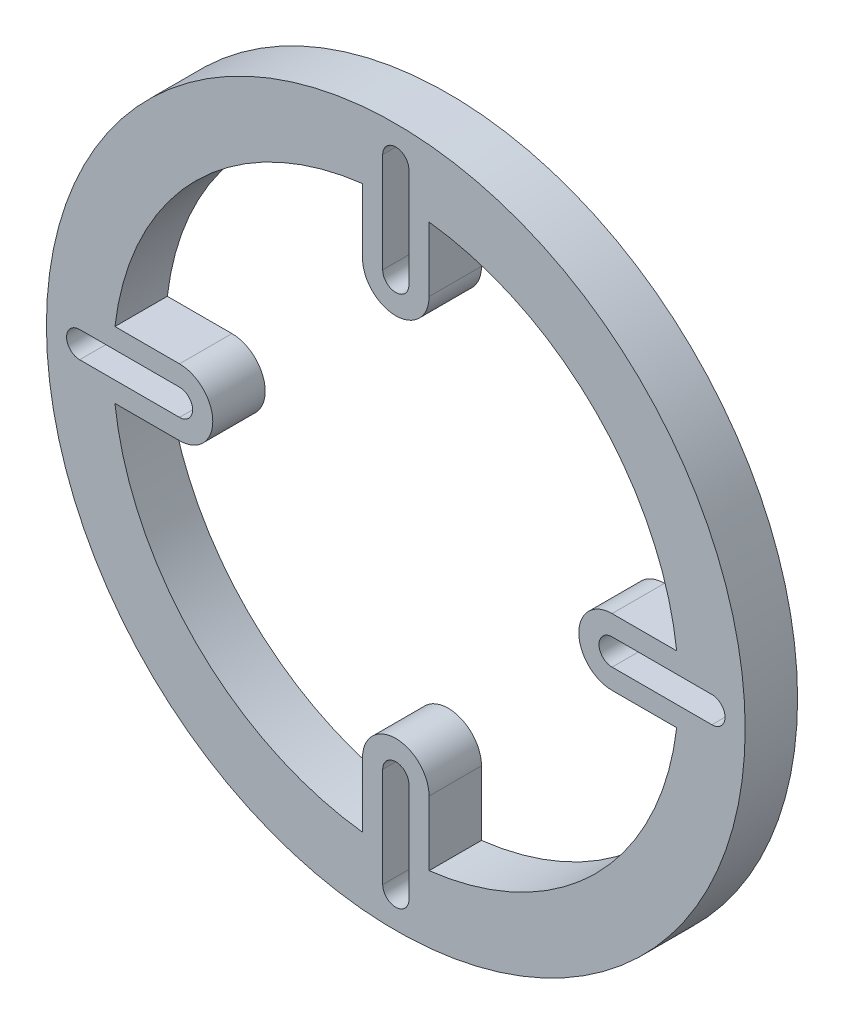
ISO-10303-21;
HEADER;
FILE_DESCRIPTION(('STEP AP214'),'2;1');
FILE_NAME('part.step','',(''),(''),'','','');
FILE_SCHEMA(('AUTOMOTIVE_DESIGN { 1 0 10303 214 1 1 1 1 }'));
ENDSEC;
DATA;
#1=APPLICATION_CONTEXT('core data for automotive mechanical design processes');
#2=APPLICATION_PROTOCOL_DEFINITION('international standard','automotive_design',2000,#1);
#3=PRODUCT_CONTEXT('',#1,'mechanical');
#4=PRODUCT('Part','Part','',(#3));
#5=PRODUCT_RELATED_PRODUCT_CATEGORY('part','',(#4));
#6=PRODUCT_DEFINITION_FORMATION('','',#4);
#7=PRODUCT_DEFINITION_CONTEXT('part definition',#1,'design');
#8=PRODUCT_DEFINITION('design','',#6,#7);
#9=PRODUCT_DEFINITION_SHAPE('','',#8);
#10=(LENGTH_UNIT() NAMED_UNIT(*) SI_UNIT(.MILLI.,.METRE.));
#11=(NAMED_UNIT(*) PLANE_ANGLE_UNIT() SI_UNIT($,.RADIAN.));
#12=(NAMED_UNIT(*) SI_UNIT($,.STERADIAN.) SOLID_ANGLE_UNIT());
#13=UNCERTAINTY_MEASURE_WITH_UNIT(LENGTH_MEASURE(1.E-05),#10,'distance_accuracy_value','');
#14=(GEOMETRIC_REPRESENTATION_CONTEXT(3) GLOBAL_UNCERTAINTY_ASSIGNED_CONTEXT((#13)) GLOBAL_UNIT_ASSIGNED_CONTEXT((#10,
#11,#12)) REPRESENTATION_CONTEXT('',''));
#15=CARTESIAN_POINT('',(0.,0.,0.));
#16=DIRECTION('',(0.,0.,1.));
#17=DIRECTION('',(1.,0.,0.));
#18=AXIS2_PLACEMENT_3D('',#15,#16,#17);
#19=CARTESIAN_POINT('',(0.,0.,8.));
#20=DIRECTION('',(0.,0.,1.));
#21=DIRECTION('',(1.,0.,0.));
#22=AXIS2_PLACEMENT_3D('',#19,#20,#21);
#23=PLANE('',#22);
#24=DIRECTION('',(1.,0.,0.));
#25=VECTOR('',#24,1.);
#26=CARTESIAN_POINT('',(0.,-2.,8.));
#27=LINE('',#26,#25);
#28=CARTESIAN_POINT('',(33.02,-2.,8.));
#29=VERTEX_POINT('',#28);
#30=CARTESIAN_POINT('',(48.26,-2.00000000000001,8.));
#31=VERTEX_POINT('',#30);
#32=EDGE_CURVE('E107',#29,#31,#27,.T.);
#33=ORIENTED_EDGE('',*,*,#32,.F.);
#34=CARTESIAN_POINT('',(33.02,0.,8.));
#35=DIRECTION('',(0.,0.,-1.));
#36=DIRECTION('',(-1.,0.,0.));
#37=AXIS2_PLACEMENT_3D('',#34,#35,#36);
#38=CIRCLE('',#37,2.);
#39=CARTESIAN_POINT('',(33.02,2.,8.));
#40=VERTEX_POINT('',#39);
#41=EDGE_CURVE('E318',#29,#40,#38,.T.);
#42=ORIENTED_EDGE('',*,*,#41,.T.);
#43=DIRECTION('',(1.,0.,0.));
#44=VECTOR('',#43,1.);
#45=CARTESIAN_POINT('',(0.,2.,8.));
#46=LINE('',#45,#44);
#47=CARTESIAN_POINT('',(48.26,2.00000000000001,8.));
#48=VERTEX_POINT('',#47);
#49=EDGE_CURVE('E322',#40,#48,#46,.T.);
#50=ORIENTED_EDGE('',*,*,#49,.T.);
#51=CARTESIAN_POINT('',(48.26,0.,8.));
#52=DIRECTION('',(0.,0.,-1.));
#53=DIRECTION('',(-1.,0.,0.));
#54=AXIS2_PLACEMENT_3D('',#51,#52,#53);
#55=CIRCLE('',#54,2.);
#56=EDGE_CURVE('E313',#48,#31,#55,.T.);
#57=ORIENTED_EDGE('',*,*,#56,.T.);
#58=EDGE_LOOP('',(#33,#42,#50,#57));
#59=FACE_BOUND('',#58,.T.);
#60=CARTESIAN_POINT('',(-33.02,0.,8.));
#61=DIRECTION('',(0.,0.,1.));
#62=DIRECTION('',(1.,0.,0.));
#63=AXIS2_PLACEMENT_3D('',#60,#61,#62);
#64=CIRCLE('',#63,2.);
#65=CARTESIAN_POINT('',(-33.02,-2.,8.));
#66=VERTEX_POINT('',#65);
#67=CARTESIAN_POINT('',(-33.02,2.,8.));
#68=VERTEX_POINT('',#67);
#69=EDGE_CURVE('E341',#66,#68,#64,.T.);
#70=ORIENTED_EDGE('',*,*,#69,.F.);
#71=DIRECTION('',(-1.,0.,0.));
#72=VECTOR('',#71,1.);
#73=CARTESIAN_POINT('',(0.,-2.,8.));
#74=LINE('',#73,#72);
#75=CARTESIAN_POINT('',(-48.26,-2.00000000000001,8.));
#76=VERTEX_POINT('',#75);
#77=EDGE_CURVE('E338',#66,#76,#74,.T.);
#78=ORIENTED_EDGE('',*,*,#77,.T.);
#79=CARTESIAN_POINT('',(-48.26,0.,8.));
#80=DIRECTION('',(0.,0.,1.));
#81=DIRECTION('',(1.,0.,0.));
#82=AXIS2_PLACEMENT_3D('',#79,#80,#81);
#83=CIRCLE('',#82,2.);
#84=CARTESIAN_POINT('',(-48.26,2.,8.));
#85=VERTEX_POINT('',#84);
#86=EDGE_CURVE('E329',#85,#76,#83,.T.);
#87=ORIENTED_EDGE('',*,*,#86,.F.);
#88=DIRECTION('',(-1.,0.,0.));
#89=VECTOR('',#88,1.);
#90=CARTESIAN_POINT('',(0.,2.,8.));
#91=LINE('',#90,#89);
#92=EDGE_CURVE('E344',#68,#85,#91,.T.);
#93=ORIENTED_EDGE('',*,*,#92,.F.);
#94=EDGE_LOOP('',(#70,#78,#87,#93));
#95=FACE_BOUND('',#94,.T.);
#96=CARTESIAN_POINT('',(0.,0.,8.));
#97=DIRECTION('',(0.,0.,1.));
#98=DIRECTION('',(1.,0.,0.));
#99=AXIS2_PLACEMENT_3D('',#96,#97,#98);
#100=CIRCLE('',#99,43.18);
#101=CARTESIAN_POINT('',(-5.08,42.8801352609807,8.));
#102=VERTEX_POINT('',#101);
#103=CARTESIAN_POINT('',(-42.8801352609807,5.08,8.));
#104=VERTEX_POINT('',#103);
#105=EDGE_CURVE('E542',#102,#104,#100,.T.);
#106=ORIENTED_EDGE('',*,*,#105,.F.);
#107=DIRECTION('',(0.,-1.,0.));
#108=VECTOR('',#107,1.);
#109=CARTESIAN_POINT('',(-5.07999999999995,-117.489421356237,8.));
#110=LINE('',#109,#108);
#111=CARTESIAN_POINT('',(-5.08,33.02,8.));
#112=VERTEX_POINT('',#111);
#113=EDGE_CURVE('E514',#102,#112,#110,.T.);
#114=ORIENTED_EDGE('',*,*,#113,.T.);
#115=CARTESIAN_POINT('',(0.,33.02,8.));
#116=DIRECTION('',(0.,0.,1.));
#117=DIRECTION('',(1.,0.,0.));
#118=AXIS2_PLACEMENT_3D('',#115,#116,#117);
#119=CIRCLE('',#118,5.08);
#120=CARTESIAN_POINT('',(5.08,33.02,8.));
#121=VERTEX_POINT('',#120);
#122=EDGE_CURVE('E500',#112,#121,#119,.T.);
#123=ORIENTED_EDGE('',*,*,#122,.T.);
#124=DIRECTION('',(0.,-1.,0.));
#125=VECTOR('',#124,1.);
#126=CARTESIAN_POINT('',(5.07999999999995,-117.489421356237,8.));
#127=LINE('',#126,#125);
#128=CARTESIAN_POINT('',(5.08,42.8801352609807,8.));
#129=VERTEX_POINT('',#128);
#130=EDGE_CURVE('E511',#129,#121,#127,.T.);
#131=ORIENTED_EDGE('',*,*,#130,.F.);
#132=CARTESIAN_POINT('',(42.8801352609807,5.08,8.));
#133=VERTEX_POINT('',#132);
#134=EDGE_CURVE('E539',#133,#129,#100,.T.);
#135=ORIENTED_EDGE('',*,*,#134,.F.);
#136=DIRECTION('',(-1.,0.,0.));
#137=VECTOR('',#136,1.);
#138=CARTESIAN_POINT('',(0.,5.08,8.));
#139=LINE('',#138,#137);
#140=CARTESIAN_POINT('',(33.02,5.08,8.));
#141=VERTEX_POINT('',#140);
#142=EDGE_CURVE('E434',#133,#141,#139,.T.);
#143=ORIENTED_EDGE('',*,*,#142,.T.);
#144=CARTESIAN_POINT('',(33.02,0.,8.));
#145=DIRECTION('',(0.,0.,-1.));
#146=DIRECTION('',(-1.,0.,0.));
#147=AXIS2_PLACEMENT_3D('',#144,#145,#146);
#148=CIRCLE('',#147,5.08);
#149=CARTESIAN_POINT('',(33.02,-5.08,8.));
#150=VERTEX_POINT('',#149);
#151=EDGE_CURVE('E420',#150,#141,#148,.T.);
#152=ORIENTED_EDGE('',*,*,#151,.F.);
#153=DIRECTION('',(-1.,0.,0.));
#154=VECTOR('',#153,1.);
#155=CARTESIAN_POINT('',(0.,-5.08,8.));
#156=LINE('',#155,#154);
#157=CARTESIAN_POINT('',(42.8801352609807,-5.08,8.));
#158=VERTEX_POINT('',#157);
#159=EDGE_CURVE('E431',#158,#150,#156,.T.);
#160=ORIENTED_EDGE('',*,*,#159,.F.);
#161=CARTESIAN_POINT('',(5.08,-42.8801352609807,8.));
#162=VERTEX_POINT('',#161);
#163=EDGE_CURVE('E545',#162,#158,#100,.T.);
#164=ORIENTED_EDGE('',*,*,#163,.F.);
#165=DIRECTION('',(0.,1.,0.));
#166=VECTOR('',#165,1.);
#167=CARTESIAN_POINT('',(5.07999999999995,117.489421356237,8.));
#168=LINE('',#167,#166);
#169=CARTESIAN_POINT('',(5.08,-33.02,8.));
#170=VERTEX_POINT('',#169);
#171=EDGE_CURVE('E487',#162,#170,#168,.T.);
#172=ORIENTED_EDGE('',*,*,#171,.T.);
#173=CARTESIAN_POINT('',(0.,-33.02,8.));
#174=DIRECTION('',(0.,0.,-1.));
#175=DIRECTION('',(1.,0.,0.));
#176=AXIS2_PLACEMENT_3D('',#173,#174,#175);
#177=CIRCLE('',#176,5.08);
#178=CARTESIAN_POINT('',(-5.08,-33.02,8.));
#179=VERTEX_POINT('',#178);
#180=EDGE_CURVE('E476',#179,#170,#177,.T.);
#181=ORIENTED_EDGE('',*,*,#180,.F.);
#182=DIRECTION('',(0.,1.,0.));
#183=VECTOR('',#182,1.);
#184=CARTESIAN_POINT('',(-5.07999999999995,117.489421356237,8.));
#185=LINE('',#184,#183);
#186=CARTESIAN_POINT('',(-5.08,-42.8801352609807,8.));
#187=VERTEX_POINT('',#186);
#188=EDGE_CURVE('E485',#187,#179,#185,.T.);
#189=ORIENTED_EDGE('',*,*,#188,.F.);
#190=CARTESIAN_POINT('',(-42.8801352609807,-5.08,8.));
#191=VERTEX_POINT('',#190);
#192=EDGE_CURVE('E544',#191,#187,#100,.T.);
#193=ORIENTED_EDGE('',*,*,#192,.F.);
#194=DIRECTION('',(1.,0.,0.));
#195=VECTOR('',#194,1.);
#196=CARTESIAN_POINT('',(0.,-5.08,8.));
#197=LINE('',#196,#195);
#198=CARTESIAN_POINT('',(-33.02,-5.08,8.));
#199=VERTEX_POINT('',#198);
#200=EDGE_CURVE('E464',#191,#199,#197,.T.);
#201=ORIENTED_EDGE('',*,*,#200,.T.);
#202=CARTESIAN_POINT('',(-33.02,0.,8.));
#203=DIRECTION('',(0.,0.,1.));
#204=DIRECTION('',(1.,0.,0.));
#205=AXIS2_PLACEMENT_3D('',#202,#203,#204);
#206=CIRCLE('',#205,5.08);
#207=CARTESIAN_POINT('',(-33.02,5.08,8.));
#208=VERTEX_POINT('',#207);
#209=EDGE_CURVE('E447',#199,#208,#206,.T.);
#210=ORIENTED_EDGE('',*,*,#209,.T.);
#211=DIRECTION('',(1.,0.,0.));
#212=VECTOR('',#211,1.);
#213=CARTESIAN_POINT('',(0.,5.08,8.));
#214=LINE('',#213,#212);
#215=EDGE_CURVE('E461',#104,#208,#214,.T.);
#216=ORIENTED_EDGE('',*,*,#215,.F.);
#217=EDGE_LOOP('',(#106,#114,#123,#131,#135,#143,#152,#160,#164,#172,#181,#189,#193,#201,#210,#216));
#218=FACE_BOUND('',#217,.T.);
#219=CARTESIAN_POINT('',(0.,0.,8.));
#220=DIRECTION('',(0.,0.,1.));
#221=DIRECTION('',(1.,0.,0.));
#222=AXIS2_PLACEMENT_3D('',#219,#220,#221);
#223=CIRCLE('',#222,53.34);
#224=CARTESIAN_POINT('',(53.34,0.,8.));
#225=VERTEX_POINT('',#224);
#226=EDGE_CURVE('E12',#225,#225,#223,.T.);
#227=ORIENTED_EDGE('',*,*,#226,.T.);
#228=EDGE_LOOP('',(#227));
#229=FACE_BOUND('',#228,.T.);
#230=DIRECTION('',(0.,-1.,0.));
#231=VECTOR('',#230,1.);
#232=CARTESIAN_POINT('',(-1.99999999999998,-117.489421356237,8.));
#233=LINE('',#232,#231);
#234=CARTESIAN_POINT('',(-2.,48.26,8.));
#235=VERTEX_POINT('',#234);
#236=CARTESIAN_POINT('',(-2.,33.02,8.));
#237=VERTEX_POINT('',#236);
#238=EDGE_CURVE('E388',#235,#237,#233,.T.);
#239=ORIENTED_EDGE('',*,*,#238,.F.);
#240=CARTESIAN_POINT('',(0.,48.26,8.));
#241=DIRECTION('',(0.,0.,1.));
#242=DIRECTION('',(1.,0.,0.));
#243=AXIS2_PLACEMENT_3D('',#240,#241,#242);
#244=CIRCLE('',#243,2.);
#245=CARTESIAN_POINT('',(2.,48.26,8.));
#246=VERTEX_POINT('',#245);
#247=EDGE_CURVE('E402',#246,#235,#244,.T.);
#248=ORIENTED_EDGE('',*,*,#247,.F.);
#249=DIRECTION('',(0.,-1.,0.));
#250=VECTOR('',#249,1.);
#251=CARTESIAN_POINT('',(1.99999999999998,-117.489421356237,8.));
#252=LINE('',#251,#250);
#253=CARTESIAN_POINT('',(2.,33.02,8.));
#254=VERTEX_POINT('',#253);
#255=EDGE_CURVE('E399',#246,#254,#252,.T.);
#256=ORIENTED_EDGE('',*,*,#255,.T.);
#257=CARTESIAN_POINT('',(0.,33.02,8.));
#258=DIRECTION('',(0.,0.,1.));
#259=DIRECTION('',(1.,0.,0.));
#260=AXIS2_PLACEMENT_3D('',#257,#258,#259);
#261=CIRCLE('',#260,2.);
#262=EDGE_CURVE('E396',#237,#254,#261,.T.);
#263=ORIENTED_EDGE('',*,*,#262,.F.);
#264=EDGE_LOOP('',(#239,#248,#256,#263));
#265=FACE_BOUND('',#264,.T.);
#266=CARTESIAN_POINT('',(0.,-48.26,8.));
#267=DIRECTION('',(0.,0.,-1.));
#268=DIRECTION('',(1.,0.,0.));
#269=AXIS2_PLACEMENT_3D('',#266,#267,#268);
#270=CIRCLE('',#269,2.);
#271=CARTESIAN_POINT('',(2.,-48.26,8.));
#272=VERTEX_POINT('',#271);
#273=CARTESIAN_POINT('',(-2.,-48.26,8.));
#274=VERTEX_POINT('',#273);
#275=EDGE_CURVE('E366',#272,#274,#270,.T.);
#276=ORIENTED_EDGE('',*,*,#275,.T.);
#277=DIRECTION('',(0.,1.,0.));
#278=VECTOR('',#277,1.);
#279=CARTESIAN_POINT('',(-1.99999999999998,117.489421356237,8.));
#280=LINE('',#279,#278);
#281=CARTESIAN_POINT('',(-2.,-33.02,8.));
#282=VERTEX_POINT('',#281);
#283=EDGE_CURVE('E357',#274,#282,#280,.T.);
#284=ORIENTED_EDGE('',*,*,#283,.T.);
#285=CARTESIAN_POINT('',(0.,-33.02,8.));
#286=DIRECTION('',(0.,0.,-1.));
#287=DIRECTION('',(1.,0.,0.));
#288=AXIS2_PLACEMENT_3D('',#285,#286,#287);
#289=CIRCLE('',#288,2.);
#290=CARTESIAN_POINT('',(2.,-33.02,8.));
#291=VERTEX_POINT('',#290);
#292=EDGE_CURVE('E372',#282,#291,#289,.T.);
#293=ORIENTED_EDGE('',*,*,#292,.T.);
#294=DIRECTION('',(0.,1.,0.));
#295=VECTOR('',#294,1.);
#296=CARTESIAN_POINT('',(1.99999999999998,117.489421356237,8.));
#297=LINE('',#296,#295);
#298=EDGE_CURVE('E369',#272,#291,#297,.T.);
#299=ORIENTED_EDGE('',*,*,#298,.F.);
#300=EDGE_LOOP('',(#276,#284,#293,#299));
#301=FACE_BOUND('',#300,.T.);
#302=ADVANCED_FACE('F92',(#59,#95,#218,#229,#265,#301),#23,.T.);
#303=CARTESIAN_POINT('',(0.,0.,0.));
#304=DIRECTION('',(0.,0.,1.));
#305=DIRECTION('',(1.,0.,0.));
#306=AXIS2_PLACEMENT_3D('',#303,#304,#305);
#307=PLANE('',#306);
#308=CARTESIAN_POINT('',(33.02,0.,0.));
#309=DIRECTION('',(0.,0.,-1.));
#310=DIRECTION('',(-1.,0.,0.));
#311=AXIS2_PLACEMENT_3D('',#308,#309,#310);
#312=CIRCLE('',#311,2.);
#313=CARTESIAN_POINT('',(33.02,-2.,0.));
#314=VERTEX_POINT('',#313);
#315=CARTESIAN_POINT('',(33.02,2.,0.));
#316=VERTEX_POINT('',#315);
#317=EDGE_CURVE('E306',#314,#316,#312,.T.);
#318=ORIENTED_EDGE('',*,*,#317,.F.);
#319=DIRECTION('',(1.,0.,0.));
#320=VECTOR('',#319,1.);
#321=CARTESIAN_POINT('',(0.,-2.,0.));
#322=LINE('',#321,#320);
#323=CARTESIAN_POINT('',(48.26,-2.00000000000001,0.));
#324=VERTEX_POINT('',#323);
#325=EDGE_CURVE('E303',#314,#324,#322,.T.);
#326=ORIENTED_EDGE('',*,*,#325,.T.);
#327=CARTESIAN_POINT('',(48.26,0.,0.));
#328=DIRECTION('',(0.,0.,-1.));
#329=DIRECTION('',(-1.,0.,0.));
#330=AXIS2_PLACEMENT_3D('',#327,#328,#329);
#331=CIRCLE('',#330,2.);
#332=CARTESIAN_POINT('',(48.26,2.,0.));
#333=VERTEX_POINT('',#332);
#334=EDGE_CURVE('E309',#333,#324,#331,.T.);
#335=ORIENTED_EDGE('',*,*,#334,.F.);
#336=DIRECTION('',(1.,0.,0.));
#337=VECTOR('',#336,1.);
#338=CARTESIAN_POINT('',(0.,2.,0.));
#339=LINE('',#338,#337);
#340=EDGE_CURVE('E317',#316,#333,#339,.T.);
#341=ORIENTED_EDGE('',*,*,#340,.F.);
#342=EDGE_LOOP('',(#318,#326,#335,#341));
#343=FACE_BOUND('',#342,.T.);
#344=DIRECTION('',(-1.,0.,0.));
#345=VECTOR('',#344,1.);
#346=CARTESIAN_POINT('',(0.,-2.,0.));
#347=LINE('',#346,#345);
#348=CARTESIAN_POINT('',(-33.02,-2.,0.));
#349=VERTEX_POINT('',#348);
#350=CARTESIAN_POINT('',(-48.26,-2.00000000000001,0.));
#351=VERTEX_POINT('',#350);
#352=EDGE_CURVE('E346',#349,#351,#347,.T.);
#353=ORIENTED_EDGE('',*,*,#352,.F.);
#354=CARTESIAN_POINT('',(-33.02,0.,0.));
#355=DIRECTION('',(0.,0.,1.));
#356=DIRECTION('',(1.,0.,0.));
#357=AXIS2_PLACEMENT_3D('',#354,#355,#356);
#358=CIRCLE('',#357,2.);
#359=CARTESIAN_POINT('',(-33.02,2.,0.));
#360=VERTEX_POINT('',#359);
#361=EDGE_CURVE('E348',#349,#360,#358,.T.);
#362=ORIENTED_EDGE('',*,*,#361,.T.);
#363=DIRECTION('',(-1.,0.,0.));
#364=VECTOR('',#363,1.);
#365=CARTESIAN_POINT('',(0.,2.,0.));
#366=LINE('',#365,#364);
#367=CARTESIAN_POINT('',(-48.26,2.00000000000001,0.));
#368=VERTEX_POINT('',#367);
#369=EDGE_CURVE('E351',#360,#368,#366,.T.);
#370=ORIENTED_EDGE('',*,*,#369,.T.);
#371=CARTESIAN_POINT('',(-48.26,0.,0.));
#372=DIRECTION('',(0.,0.,1.));
#373=DIRECTION('',(1.,0.,0.));
#374=AXIS2_PLACEMENT_3D('',#371,#372,#373);
#375=CIRCLE('',#374,2.);
#376=EDGE_CURVE('E335',#368,#351,#375,.T.);
#377=ORIENTED_EDGE('',*,*,#376,.T.);
#378=EDGE_LOOP('',(#353,#362,#370,#377));
#379=FACE_BOUND('',#378,.T.);
#380=CARTESIAN_POINT('',(0.,0.,0.));
#381=DIRECTION('',(0.,0.,1.));
#382=DIRECTION('',(1.,0.,0.));
#383=AXIS2_PLACEMENT_3D('',#380,#381,#382);
#384=CIRCLE('',#383,43.18);
#385=CARTESIAN_POINT('',(-5.08,42.8801352609807,0.));
#386=VERTEX_POINT('',#385);
#387=CARTESIAN_POINT('',(-42.8801352609807,5.08,0.));
#388=VERTEX_POINT('',#387);
#389=EDGE_CURVE('E536',#386,#388,#384,.T.);
#390=ORIENTED_EDGE('',*,*,#389,.T.);
#391=DIRECTION('',(1.,0.,0.));
#392=VECTOR('',#391,1.);
#393=CARTESIAN_POINT('',(0.,5.08,0.));
#394=LINE('',#393,#392);
#395=CARTESIAN_POINT('',(-33.02,5.08,0.));
#396=VERTEX_POINT('',#395);
#397=EDGE_CURVE('E467',#388,#396,#394,.T.);
#398=ORIENTED_EDGE('',*,*,#397,.T.);
#399=CARTESIAN_POINT('',(-33.02,0.,0.));
#400=DIRECTION('',(0.,0.,1.));
#401=DIRECTION('',(1.,0.,0.));
#402=AXIS2_PLACEMENT_3D('',#399,#400,#401);
#403=CIRCLE('',#402,5.08);
#404=CARTESIAN_POINT('',(-33.02,-5.08,0.));
#405=VERTEX_POINT('',#404);
#406=EDGE_CURVE('E458',#405,#396,#403,.T.);
#407=ORIENTED_EDGE('',*,*,#406,.F.);
#408=DIRECTION('',(1.,0.,0.));
#409=VECTOR('',#408,1.);
#410=CARTESIAN_POINT('',(0.,-5.08,0.));
#411=LINE('',#410,#409);
#412=CARTESIAN_POINT('',(-42.8801352609807,-5.08,0.));
#413=VERTEX_POINT('',#412);
#414=EDGE_CURVE('E470',#413,#405,#411,.T.);
#415=ORIENTED_EDGE('',*,*,#414,.F.);
#416=CARTESIAN_POINT('',(-5.08,-42.8801352609807,0.));
#417=VERTEX_POINT('',#416);
#418=EDGE_CURVE('E540',#413,#417,#384,.T.);
#419=ORIENTED_EDGE('',*,*,#418,.T.);
#420=DIRECTION('',(0.,1.,0.));
#421=VECTOR('',#420,1.);
#422=CARTESIAN_POINT('',(-5.07999999999995,117.489421356237,0.));
#423=LINE('',#422,#421);
#424=CARTESIAN_POINT('',(-5.08,-33.02,0.));
#425=VERTEX_POINT('',#424);
#426=EDGE_CURVE('E492',#417,#425,#423,.T.);
#427=ORIENTED_EDGE('',*,*,#426,.T.);
#428=CARTESIAN_POINT('',(0.,-33.02,0.));
#429=DIRECTION('',(0.,0.,-1.));
#430=DIRECTION('',(1.,0.,0.));
#431=AXIS2_PLACEMENT_3D('',#428,#429,#430);
#432=CIRCLE('',#431,5.08);
#433=CARTESIAN_POINT('',(5.08,-33.02,0.));
#434=VERTEX_POINT('',#433);
#435=EDGE_CURVE('E490',#425,#434,#432,.T.);
#436=ORIENTED_EDGE('',*,*,#435,.T.);
#437=DIRECTION('',(0.,1.,0.));
#438=VECTOR('',#437,1.);
#439=CARTESIAN_POINT('',(5.07999999999995,117.489421356237,0.));
#440=LINE('',#439,#438);
#441=CARTESIAN_POINT('',(5.08,-42.8801352609807,0.));
#442=VERTEX_POINT('',#441);
#443=EDGE_CURVE('E494',#442,#434,#440,.T.);
#444=ORIENTED_EDGE('',*,*,#443,.F.);
#445=CARTESIAN_POINT('',(42.8801352609807,-5.08,0.));
#446=VERTEX_POINT('',#445);
#447=EDGE_CURVE('E541',#442,#446,#384,.T.);
#448=ORIENTED_EDGE('',*,*,#447,.T.);
#449=DIRECTION('',(-1.,0.,0.));
#450=VECTOR('',#449,1.);
#451=CARTESIAN_POINT('',(0.,-5.08,0.));
#452=LINE('',#451,#450);
#453=CARTESIAN_POINT('',(33.02,-5.08,0.));
#454=VERTEX_POINT('',#453);
#455=EDGE_CURVE('E437',#446,#454,#452,.T.);
#456=ORIENTED_EDGE('',*,*,#455,.T.);
#457=CARTESIAN_POINT('',(33.02,0.,0.));
#458=DIRECTION('',(0.,0.,-1.));
#459=DIRECTION('',(-1.,0.,0.));
#460=AXIS2_PLACEMENT_3D('',#457,#458,#459);
#461=CIRCLE('',#460,5.08);
#462=CARTESIAN_POINT('',(33.02,5.08,0.));
#463=VERTEX_POINT('',#462);
#464=EDGE_CURVE('E428',#454,#463,#461,.T.);
#465=ORIENTED_EDGE('',*,*,#464,.T.);
#466=DIRECTION('',(-1.,0.,0.));
#467=VECTOR('',#466,1.);
#468=CARTESIAN_POINT('',(0.,5.08,0.));
#469=LINE('',#468,#467);
#470=CARTESIAN_POINT('',(42.8801352609807,5.08,0.));
#471=VERTEX_POINT('',#470);
#472=EDGE_CURVE('E440',#471,#463,#469,.T.);
#473=ORIENTED_EDGE('',*,*,#472,.F.);
#474=CARTESIAN_POINT('',(5.08,42.8801352609807,0.));
#475=VERTEX_POINT('',#474);
#476=EDGE_CURVE('E528',#471,#475,#384,.T.);
#477=ORIENTED_EDGE('',*,*,#476,.T.);
#478=DIRECTION('',(0.,-1.,0.));
#479=VECTOR('',#478,1.);
#480=CARTESIAN_POINT('',(5.07999999999995,-117.489421356237,0.));
#481=LINE('',#480,#479);
#482=CARTESIAN_POINT('',(5.08,33.02,0.));
#483=VERTEX_POINT('',#482);
#484=EDGE_CURVE('E520',#475,#483,#481,.T.);
#485=ORIENTED_EDGE('',*,*,#484,.T.);
#486=CARTESIAN_POINT('',(0.,33.02,0.));
#487=DIRECTION('',(0.,0.,1.));
#488=DIRECTION('',(1.,0.,0.));
#489=AXIS2_PLACEMENT_3D('',#486,#487,#488);
#490=CIRCLE('',#489,5.08);
#491=CARTESIAN_POINT('',(-5.08,33.02,0.));
#492=VERTEX_POINT('',#491);
#493=EDGE_CURVE('E517',#492,#483,#490,.T.);
#494=ORIENTED_EDGE('',*,*,#493,.F.);
#495=DIRECTION('',(0.,-1.,0.));
#496=VECTOR('',#495,1.);
#497=CARTESIAN_POINT('',(-5.07999999999995,-117.489421356237,0.));
#498=LINE('',#497,#496);
#499=EDGE_CURVE('E522',#386,#492,#498,.T.);
#500=ORIENTED_EDGE('',*,*,#499,.F.);
#501=EDGE_LOOP('',(#390,#398,#407,#415,#419,#427,#436,#444,#448,#456,#465,#473,#477,#485,#494,#500));
#502=FACE_BOUND('',#501,.T.);
#503=CARTESIAN_POINT('',(0.,0.,0.));
#504=DIRECTION('',(0.,0.,1.));
#505=DIRECTION('',(1.,0.,0.));
#506=AXIS2_PLACEMENT_3D('',#503,#504,#505);
#507=CIRCLE('',#506,53.34);
#508=CARTESIAN_POINT('',(53.34,0.,0.));
#509=VERTEX_POINT('',#508);
#510=EDGE_CURVE('E100',#509,#509,#507,.T.);
#511=ORIENTED_EDGE('',*,*,#510,.F.);
#512=EDGE_LOOP('',(#511));
#513=FACE_BOUND('',#512,.T.);
#514=CARTESIAN_POINT('',(0.,48.26,0.));
#515=DIRECTION('',(0.,0.,1.));
#516=DIRECTION('',(1.,0.,0.));
#517=AXIS2_PLACEMENT_3D('',#514,#515,#516);
#518=CIRCLE('',#517,2.);
#519=CARTESIAN_POINT('',(2.,48.26,0.));
#520=VERTEX_POINT('',#519);
#521=CARTESIAN_POINT('',(-2.,48.26,0.));
#522=VERTEX_POINT('',#521);
#523=EDGE_CURVE('E414',#520,#522,#518,.T.);
#524=ORIENTED_EDGE('',*,*,#523,.T.);
#525=DIRECTION('',(0.,-1.,0.));
#526=VECTOR('',#525,1.);
#527=CARTESIAN_POINT('',(-1.99999999999998,-117.489421356237,0.));
#528=LINE('',#527,#526);
#529=CARTESIAN_POINT('',(-2.,33.02,0.));
#530=VERTEX_POINT('',#529);
#531=EDGE_CURVE('E405',#522,#530,#528,.T.);
#532=ORIENTED_EDGE('',*,*,#531,.T.);
#533=CARTESIAN_POINT('',(0.,33.02,0.));
#534=DIRECTION('',(0.,0.,1.));
#535=DIRECTION('',(1.,0.,0.));
#536=AXIS2_PLACEMENT_3D('',#533,#534,#535);
#537=CIRCLE('',#536,2.);
#538=CARTESIAN_POINT('',(2.,33.02,0.));
#539=VERTEX_POINT('',#538);
#540=EDGE_CURVE('E408',#530,#539,#537,.T.);
#541=ORIENTED_EDGE('',*,*,#540,.T.);
#542=DIRECTION('',(0.,-1.,0.));
#543=VECTOR('',#542,1.);
#544=CARTESIAN_POINT('',(1.99999999999998,-117.489421356237,0.));
#545=LINE('',#544,#543);
#546=EDGE_CURVE('E411',#520,#539,#545,.T.);
#547=ORIENTED_EDGE('',*,*,#546,.F.);
#548=EDGE_LOOP('',(#524,#532,#541,#547));
#549=FACE_BOUND('',#548,.T.);
#550=DIRECTION('',(0.,1.,0.));
#551=VECTOR('',#550,1.);
#552=CARTESIAN_POINT('',(-1.99999999999998,117.489421356237,0.));
#553=LINE('',#552,#551);
#554=CARTESIAN_POINT('',(-2.,-48.26,0.));
#555=VERTEX_POINT('',#554);
#556=CARTESIAN_POINT('',(-2.,-33.02,0.));
#557=VERTEX_POINT('',#556);
#558=EDGE_CURVE('E375',#555,#557,#553,.T.);
#559=ORIENTED_EDGE('',*,*,#558,.F.);
#560=CARTESIAN_POINT('',(0.,-48.26,0.));
#561=DIRECTION('',(0.,0.,-1.));
#562=DIRECTION('',(1.,0.,0.));
#563=AXIS2_PLACEMENT_3D('',#560,#561,#562);
#564=CIRCLE('',#563,2.);
#565=CARTESIAN_POINT('',(2.,-48.26,0.));
#566=VERTEX_POINT('',#565);
#567=EDGE_CURVE('E377',#566,#555,#564,.T.);
#568=ORIENTED_EDGE('',*,*,#567,.F.);
#569=DIRECTION('',(0.,1.,0.));
#570=VECTOR('',#569,1.);
#571=CARTESIAN_POINT('',(1.99999999999998,117.489421356237,0.));
#572=LINE('',#571,#570);
#573=CARTESIAN_POINT('',(2.,-33.02,0.));
#574=VERTEX_POINT('',#573);
#575=EDGE_CURVE('E379',#566,#574,#572,.T.);
#576=ORIENTED_EDGE('',*,*,#575,.T.);
#577=CARTESIAN_POINT('',(0.,-33.02,0.));
#578=DIRECTION('',(0.,0.,-1.));
#579=DIRECTION('',(1.,0.,0.));
#580=AXIS2_PLACEMENT_3D('',#577,#578,#579);
#581=CIRCLE('',#580,2.);
#582=EDGE_CURVE('E382',#557,#574,#581,.T.);
#583=ORIENTED_EDGE('',*,*,#582,.F.);
#584=EDGE_LOOP('',(#559,#568,#576,#583));
#585=FACE_BOUND('',#584,.T.);
#586=ADVANCED_FACE('F315',(#343,#379,#502,#513,#549,#585),#307,.F.);
#587=CARTESIAN_POINT('',(0.,0.,8.));
#588=DIRECTION('',(0.,0.,-1.));
#589=DIRECTION('',(-1.,0.,0.));
#590=AXIS2_PLACEMENT_3D('',#587,#588,#589);
#591=CYLINDRICAL_SURFACE('',#590,43.18);
#592=ORIENTED_EDGE('',*,*,#163,.T.);
#593=DIRECTION('',(0.,0.,1.));
#594=VECTOR('',#593,1.);
#595=CARTESIAN_POINT('',(42.8801352609807,-5.08,0.));
#596=LINE('',#595,#594);
#597=EDGE_CURVE('E451',#446,#158,#596,.T.);
#598=ORIENTED_EDGE('',*,*,#597,.F.);
#599=ORIENTED_EDGE('',*,*,#447,.F.);
#600=DIRECTION('',(0.,0.,1.));
#601=VECTOR('',#600,1.);
#602=CARTESIAN_POINT('',(5.08,-42.8801352609807,0.));
#603=LINE('',#602,#601);
#604=EDGE_CURVE('E501',#442,#162,#603,.T.);
#605=ORIENTED_EDGE('',*,*,#604,.T.);
#606=EDGE_LOOP('',(#592,#598,#599,#605));
#607=FACE_BOUND('',#606,.T.);
#608=ADVANCED_FACE('F552',(#607),#591,.F.);
#609=ORIENTED_EDGE('',*,*,#105,.T.);
#610=DIRECTION('',(0.,0.,1.));
#611=VECTOR('',#610,1.);
#612=CARTESIAN_POINT('',(-42.8801352609807,5.08,0.));
#613=LINE('',#612,#611);
#614=EDGE_CURVE('E480',#388,#104,#613,.T.);
#615=ORIENTED_EDGE('',*,*,#614,.F.);
#616=ORIENTED_EDGE('',*,*,#389,.F.);
#617=DIRECTION('',(0.,0.,1.));
#618=VECTOR('',#617,1.);
#619=CARTESIAN_POINT('',(-5.08,42.8801352609807,0.));
#620=LINE('',#619,#618);
#621=EDGE_CURVE('E529',#386,#102,#620,.T.);
#622=ORIENTED_EDGE('',*,*,#621,.T.);
#623=EDGE_LOOP('',(#609,#615,#616,#622));
#624=FACE_BOUND('',#623,.T.);
#625=ADVANCED_FACE('F780',(#624),#591,.F.);
#626=DIRECTION('',(0.,0.,1.));
#627=VECTOR('',#626,1.);
#628=CARTESIAN_POINT('',(-42.8801352609807,-5.08,0.));
#629=LINE('',#628,#627);
#630=EDGE_CURVE('E477',#413,#191,#629,.T.);
#631=ORIENTED_EDGE('',*,*,#630,.T.);
#632=ORIENTED_EDGE('',*,*,#192,.T.);
#633=DIRECTION('',(0.,0.,1.));
#634=VECTOR('',#633,1.);
#635=CARTESIAN_POINT('',(-5.08,-42.8801352609807,0.));
#636=LINE('',#635,#634);
#637=EDGE_CURVE('E504',#417,#187,#636,.T.);
#638=ORIENTED_EDGE('',*,*,#637,.F.);
#639=ORIENTED_EDGE('',*,*,#418,.F.);
#640=EDGE_LOOP('',(#631,#632,#638,#639));
#641=FACE_BOUND('',#640,.T.);
#642=ADVANCED_FACE('F596',(#641),#591,.F.);
#643=CARTESIAN_POINT('',(0.,0.,8.));
#644=DIRECTION('',(0.,0.,-1.));
#645=DIRECTION('',(-1.,0.,0.));
#646=AXIS2_PLACEMENT_3D('',#643,#644,#645);
#647=CYLINDRICAL_SURFACE('',#646,53.34);
#648=ORIENTED_EDGE('',*,*,#226,.F.);
#649=EDGE_LOOP('',(#648));
#650=FACE_BOUND('',#649,.T.);
#651=ORIENTED_EDGE('',*,*,#510,.T.);
#652=EDGE_LOOP('',(#651));
#653=FACE_BOUND('',#652,.T.);
#654=ADVANCED_FACE('F94',(#650,#653),#647,.T.);
#655=DIRECTION('',(0.,0.,1.));
#656=VECTOR('',#655,1.);
#657=CARTESIAN_POINT('',(42.8801352609807,5.08,0.));
#658=LINE('',#657,#656);
#659=EDGE_CURVE('E448',#471,#133,#658,.T.);
#660=ORIENTED_EDGE('',*,*,#659,.T.);
#661=ORIENTED_EDGE('',*,*,#134,.T.);
#662=DIRECTION('',(0.,0.,1.));
#663=VECTOR('',#662,1.);
#664=CARTESIAN_POINT('',(5.08,42.8801352609807,0.));
#665=LINE('',#664,#663);
#666=EDGE_CURVE('E532',#475,#129,#665,.T.);
#667=ORIENTED_EDGE('',*,*,#666,.F.);
#668=ORIENTED_EDGE('',*,*,#476,.F.);
#669=EDGE_LOOP('',(#660,#661,#667,#668));
#670=FACE_BOUND('',#669,.T.);
#671=ADVANCED_FACE('F591',(#670),#591,.F.);
#672=CARTESIAN_POINT('',(0.,33.02,0.));
#673=DIRECTION('',(0.,0.,1.));
#674=DIRECTION('',(1.,0.,0.));
#675=AXIS2_PLACEMENT_3D('',#672,#673,#674);
#676=CYLINDRICAL_SURFACE('',#675,5.08);
#677=ORIENTED_EDGE('',*,*,#122,.F.);
#678=DIRECTION('',(0.,0.,1.));
#679=VECTOR('',#678,1.);
#680=CARTESIAN_POINT('',(-5.08,33.02,0.));
#681=LINE('',#680,#679);
#682=EDGE_CURVE('E526',#492,#112,#681,.T.);
#683=ORIENTED_EDGE('',*,*,#682,.F.);
#684=ORIENTED_EDGE('',*,*,#493,.T.);
#685=DIRECTION('',(0.,0.,1.));
#686=VECTOR('',#685,1.);
#687=CARTESIAN_POINT('',(5.08,33.02,0.));
#688=LINE('',#687,#686);
#689=EDGE_CURVE('E525',#483,#121,#688,.T.);
#690=ORIENTED_EDGE('',*,*,#689,.T.);
#691=EDGE_LOOP('',(#677,#683,#684,#690));
#692=FACE_BOUND('',#691,.T.);
#693=ADVANCED_FACE('F594',(#692),#676,.T.);
#694=CARTESIAN_POINT('',(-5.07999999999995,-117.489421356237,0.));
#695=DIRECTION('',(-1.,0.,0.));
#696=DIRECTION('',(0.,-1.,0.));
#697=AXIS2_PLACEMENT_3D('',#694,#695,#696);
#698=PLANE('',#697);
#699=ORIENTED_EDGE('',*,*,#113,.F.);
#700=ORIENTED_EDGE('',*,*,#621,.F.);
#701=ORIENTED_EDGE('',*,*,#499,.T.);
#702=ORIENTED_EDGE('',*,*,#682,.T.);
#703=EDGE_LOOP('',(#699,#700,#701,#702));
#704=FACE_BOUND('',#703,.T.);
#705=ADVANCED_FACE('F599',(#704),#698,.T.);
#706=CARTESIAN_POINT('',(5.07999999999995,-117.489421356237,0.));
#707=DIRECTION('',(-1.,0.,0.));
#708=DIRECTION('',(0.,-1.,0.));
#709=AXIS2_PLACEMENT_3D('',#706,#707,#708);
#710=PLANE('',#709);
#711=ORIENTED_EDGE('',*,*,#130,.T.);
#712=ORIENTED_EDGE('',*,*,#689,.F.);
#713=ORIENTED_EDGE('',*,*,#484,.F.);
#714=ORIENTED_EDGE('',*,*,#666,.T.);
#715=EDGE_LOOP('',(#711,#712,#713,#714));
#716=FACE_BOUND('',#715,.T.);
#717=ADVANCED_FACE('F601',(#716),#710,.F.);
#718=CARTESIAN_POINT('',(0.,-33.02,0.));
#719=DIRECTION('',(0.,0.,1.));
#720=DIRECTION('',(1.,0.,0.));
#721=AXIS2_PLACEMENT_3D('',#718,#719,#720);
#722=CYLINDRICAL_SURFACE('',#721,5.08);
#723=ORIENTED_EDGE('',*,*,#180,.T.);
#724=DIRECTION('',(0.,0.,1.));
#725=VECTOR('',#724,1.);
#726=CARTESIAN_POINT('',(5.08,-33.02,0.));
#727=LINE('',#726,#725);
#728=EDGE_CURVE('E498',#434,#170,#727,.T.);
#729=ORIENTED_EDGE('',*,*,#728,.F.);
#730=ORIENTED_EDGE('',*,*,#435,.F.);
#731=DIRECTION('',(0.,0.,1.));
#732=VECTOR('',#731,1.);
#733=CARTESIAN_POINT('',(-5.08,-33.02,0.));
#734=LINE('',#733,#732);
#735=EDGE_CURVE('E497',#425,#179,#734,.T.);
#736=ORIENTED_EDGE('',*,*,#735,.T.);
#737=EDGE_LOOP('',(#723,#729,#730,#736));
#738=FACE_BOUND('',#737,.T.);
#739=ADVANCED_FACE('F604',(#738),#722,.T.);
#740=CARTESIAN_POINT('',(5.07999999999995,117.489421356237,0.));
#741=DIRECTION('',(1.,0.,0.));
#742=DIRECTION('',(0.,1.,0.));
#743=AXIS2_PLACEMENT_3D('',#740,#741,#742);
#744=PLANE('',#743);
#745=ORIENTED_EDGE('',*,*,#171,.F.);
#746=ORIENTED_EDGE('',*,*,#604,.F.);
#747=ORIENTED_EDGE('',*,*,#443,.T.);
#748=ORIENTED_EDGE('',*,*,#728,.T.);
#749=EDGE_LOOP('',(#745,#746,#747,#748));
#750=FACE_BOUND('',#749,.T.);
#751=ADVANCED_FACE('F611',(#750),#744,.T.);
#752=CARTESIAN_POINT('',(-5.07999999999995,117.489421356237,0.));
#753=DIRECTION('',(1.,0.,0.));
#754=DIRECTION('',(0.,1.,0.));
#755=AXIS2_PLACEMENT_3D('',#752,#753,#754);
#756=PLANE('',#755);
#757=ORIENTED_EDGE('',*,*,#188,.T.);
#758=ORIENTED_EDGE('',*,*,#735,.F.);
#759=ORIENTED_EDGE('',*,*,#426,.F.);
#760=ORIENTED_EDGE('',*,*,#637,.T.);
#761=EDGE_LOOP('',(#757,#758,#759,#760));
#762=FACE_BOUND('',#761,.T.);
#763=ADVANCED_FACE('F613',(#762),#756,.F.);
#764=CARTESIAN_POINT('',(0.,-5.08,0.));
#765=DIRECTION('',(0.,-1.,0.));
#766=DIRECTION('',(0.,0.,-1.));
#767=AXIS2_PLACEMENT_3D('',#764,#765,#766);
#768=PLANE('',#767);
#769=ORIENTED_EDGE('',*,*,#200,.F.);
#770=ORIENTED_EDGE('',*,*,#630,.F.);
#771=ORIENTED_EDGE('',*,*,#414,.T.);
#772=DIRECTION('',(0.,0.,1.));
#773=VECTOR('',#772,1.);
#774=CARTESIAN_POINT('',(-33.02,-5.08,0.));
#775=LINE('',#774,#773);
#776=EDGE_CURVE('E474',#405,#199,#775,.T.);
#777=ORIENTED_EDGE('',*,*,#776,.T.);
#778=EDGE_LOOP('',(#769,#770,#771,#777));
#779=FACE_BOUND('',#778,.T.);
#780=ADVANCED_FACE('F616',(#779),#768,.T.);
#781=CARTESIAN_POINT('',(0.,5.08,0.));
#782=DIRECTION('',(0.,-1.,0.));
#783=DIRECTION('',(0.,0.,-1.));
#784=AXIS2_PLACEMENT_3D('',#781,#782,#783);
#785=PLANE('',#784);
#786=ORIENTED_EDGE('',*,*,#215,.T.);
#787=DIRECTION('',(0.,0.,1.));
#788=VECTOR('',#787,1.);
#789=CARTESIAN_POINT('',(-33.02,5.08,0.));
#790=LINE('',#789,#788);
#791=EDGE_CURVE('E473',#396,#208,#790,.T.);
#792=ORIENTED_EDGE('',*,*,#791,.F.);
#793=ORIENTED_EDGE('',*,*,#397,.F.);
#794=ORIENTED_EDGE('',*,*,#614,.T.);
#795=EDGE_LOOP('',(#786,#792,#793,#794));
#796=FACE_BOUND('',#795,.T.);
#797=ADVANCED_FACE('F622',(#796),#785,.F.);
#798=CARTESIAN_POINT('',(-33.02,0.,0.));
#799=DIRECTION('',(0.,0.,1.));
#800=DIRECTION('',(1.,0.,0.));
#801=AXIS2_PLACEMENT_3D('',#798,#799,#800);
#802=CYLINDRICAL_SURFACE('',#801,5.08);
#803=ORIENTED_EDGE('',*,*,#776,.F.);
#804=ORIENTED_EDGE('',*,*,#406,.T.);
#805=ORIENTED_EDGE('',*,*,#791,.T.);
#806=ORIENTED_EDGE('',*,*,#209,.F.);
#807=EDGE_LOOP('',(#803,#804,#805,#806));
#808=FACE_BOUND('',#807,.T.);
#809=ADVANCED_FACE('F618',(#808),#802,.T.);
#810=CARTESIAN_POINT('',(0.,5.08,0.));
#811=DIRECTION('',(0.,1.,0.));
#812=DIRECTION('',(0.,0.,1.));
#813=AXIS2_PLACEMENT_3D('',#810,#811,#812);
#814=PLANE('',#813);
#815=ORIENTED_EDGE('',*,*,#142,.F.);
#816=ORIENTED_EDGE('',*,*,#659,.F.);
#817=ORIENTED_EDGE('',*,*,#472,.T.);
#818=DIRECTION('',(0.,0.,1.));
#819=VECTOR('',#818,1.);
#820=CARTESIAN_POINT('',(33.02,5.08,0.));
#821=LINE('',#820,#819);
#822=EDGE_CURVE('E444',#463,#141,#821,.T.);
#823=ORIENTED_EDGE('',*,*,#822,.T.);
#824=EDGE_LOOP('',(#815,#816,#817,#823));
#825=FACE_BOUND('',#824,.T.);
#826=ADVANCED_FACE('F626',(#825),#814,.T.);
#827=CARTESIAN_POINT('',(0.,-5.08,0.));
#828=DIRECTION('',(0.,1.,0.));
#829=DIRECTION('',(0.,0.,1.));
#830=AXIS2_PLACEMENT_3D('',#827,#828,#829);
#831=PLANE('',#830);
#832=ORIENTED_EDGE('',*,*,#159,.T.);
#833=DIRECTION('',(0.,0.,1.));
#834=VECTOR('',#833,1.);
#835=CARTESIAN_POINT('',(33.02,-5.08,0.));
#836=LINE('',#835,#834);
#837=EDGE_CURVE('E443',#454,#150,#836,.T.);
#838=ORIENTED_EDGE('',*,*,#837,.F.);
#839=ORIENTED_EDGE('',*,*,#455,.F.);
#840=ORIENTED_EDGE('',*,*,#597,.T.);
#841=EDGE_LOOP('',(#832,#838,#839,#840));
#842=FACE_BOUND('',#841,.T.);
#843=ADVANCED_FACE('F633',(#842),#831,.F.);
#844=CARTESIAN_POINT('',(33.02,0.,0.));
#845=DIRECTION('',(0.,0.,1.));
#846=DIRECTION('',(1.,0.,0.));
#847=AXIS2_PLACEMENT_3D('',#844,#845,#846);
#848=CYLINDRICAL_SURFACE('',#847,5.08);
#849=ORIENTED_EDGE('',*,*,#151,.T.);
#850=ORIENTED_EDGE('',*,*,#822,.F.);
#851=ORIENTED_EDGE('',*,*,#464,.F.);
#852=ORIENTED_EDGE('',*,*,#837,.T.);
#853=EDGE_LOOP('',(#849,#850,#851,#852));
#854=FACE_BOUND('',#853,.T.);
#855=ADVANCED_FACE('F636',(#854),#848,.T.);
#856=CARTESIAN_POINT('',(-1.99999999999998,-117.489421356237,0.));
#857=DIRECTION('',(-1.,0.,0.));
#858=DIRECTION('',(0.,-1.,0.));
#859=AXIS2_PLACEMENT_3D('',#856,#857,#858);
#860=PLANE('',#859);
#861=ORIENTED_EDGE('',*,*,#238,.T.);
#862=DIRECTION('',(0.,0.,1.));
#863=VECTOR('',#862,1.);
#864=CARTESIAN_POINT('',(-2.,33.02,0.));
#865=LINE('',#864,#863);
#866=EDGE_CURVE('E417',#530,#237,#865,.T.);
#867=ORIENTED_EDGE('',*,*,#866,.F.);
#868=ORIENTED_EDGE('',*,*,#531,.F.);
#869=DIRECTION('',(0.,0.,1.));
#870=VECTOR('',#869,1.);
#871=CARTESIAN_POINT('',(-2.,48.26,0.));
#872=LINE('',#871,#870);
#873=EDGE_CURVE('E418',#522,#235,#872,.T.);
#874=ORIENTED_EDGE('',*,*,#873,.T.);
#875=EDGE_LOOP('',(#861,#867,#868,#874));
#876=FACE_BOUND('',#875,.T.);
#877=ADVANCED_FACE('F643',(#876),#860,.F.);
#878=CARTESIAN_POINT('',(0.,48.26,0.));
#879=DIRECTION('',(0.,0.,1.));
#880=DIRECTION('',(1.,0.,0.));
#881=AXIS2_PLACEMENT_3D('',#878,#879,#880);
#882=CYLINDRICAL_SURFACE('',#881,2.);
#883=ORIENTED_EDGE('',*,*,#247,.T.);
#884=ORIENTED_EDGE('',*,*,#873,.F.);
#885=ORIENTED_EDGE('',*,*,#523,.F.);
#886=DIRECTION('',(0.,0.,1.));
#887=VECTOR('',#886,1.);
#888=CARTESIAN_POINT('',(2.,48.26,0.));
#889=LINE('',#888,#887);
#890=EDGE_CURVE('E421',#520,#246,#889,.T.);
#891=ORIENTED_EDGE('',*,*,#890,.T.);
#892=EDGE_LOOP('',(#883,#884,#885,#891));
#893=FACE_BOUND('',#892,.T.);
#894=ADVANCED_FACE('F647',(#893),#882,.F.);
#895=CARTESIAN_POINT('',(1.99999999999998,-117.489421356237,0.));
#896=DIRECTION('',(-1.,0.,0.));
#897=DIRECTION('',(0.,-1.,0.));
#898=AXIS2_PLACEMENT_3D('',#895,#896,#897);
#899=PLANE('',#898);
#900=ORIENTED_EDGE('',*,*,#255,.F.);
#901=ORIENTED_EDGE('',*,*,#890,.F.);
#902=ORIENTED_EDGE('',*,*,#546,.T.);
#903=DIRECTION('',(0.,0.,1.));
#904=VECTOR('',#903,1.);
#905=CARTESIAN_POINT('',(2.,33.02,0.));
#906=LINE('',#905,#904);
#907=EDGE_CURVE('E423',#539,#254,#906,.T.);
#908=ORIENTED_EDGE('',*,*,#907,.T.);
#909=EDGE_LOOP('',(#900,#901,#902,#908));
#910=FACE_BOUND('',#909,.T.);
#911=ADVANCED_FACE('F652',(#910),#899,.T.);
#912=CARTESIAN_POINT('',(0.,33.02,0.));
#913=DIRECTION('',(0.,0.,1.));
#914=DIRECTION('',(1.,0.,0.));
#915=AXIS2_PLACEMENT_3D('',#912,#913,#914);
#916=CYLINDRICAL_SURFACE('',#915,2.);
#917=ORIENTED_EDGE('',*,*,#262,.T.);
#918=ORIENTED_EDGE('',*,*,#907,.F.);
#919=ORIENTED_EDGE('',*,*,#540,.F.);
#920=ORIENTED_EDGE('',*,*,#866,.T.);
#921=EDGE_LOOP('',(#917,#918,#919,#920));
#922=FACE_BOUND('',#921,.T.);
#923=ADVANCED_FACE('F649',(#922),#916,.F.);
#924=CARTESIAN_POINT('',(-1.99999999999998,117.489421356237,0.));
#925=DIRECTION('',(1.,0.,0.));
#926=DIRECTION('',(0.,1.,0.));
#927=AXIS2_PLACEMENT_3D('',#924,#925,#926);
#928=PLANE('',#927);
#929=ORIENTED_EDGE('',*,*,#283,.F.);
#930=DIRECTION('',(0.,0.,1.));
#931=VECTOR('',#930,1.);
#932=CARTESIAN_POINT('',(-2.,-48.26,0.));
#933=LINE('',#932,#931);
#934=EDGE_CURVE('E384',#555,#274,#933,.T.);
#935=ORIENTED_EDGE('',*,*,#934,.F.);
#936=ORIENTED_EDGE('',*,*,#558,.T.);
#937=DIRECTION('',(0.,0.,1.));
#938=VECTOR('',#937,1.);
#939=CARTESIAN_POINT('',(-2.,-33.02,0.));
#940=LINE('',#939,#938);
#941=EDGE_CURVE('E385',#557,#282,#940,.T.);
#942=ORIENTED_EDGE('',*,*,#941,.T.);
#943=EDGE_LOOP('',(#929,#935,#936,#942));
#944=FACE_BOUND('',#943,.T.);
#945=ADVANCED_FACE('F563',(#944),#928,.T.);
#946=CARTESIAN_POINT('',(0.,-33.02,0.));
#947=DIRECTION('',(0.,0.,1.));
#948=DIRECTION('',(1.,0.,0.));
#949=AXIS2_PLACEMENT_3D('',#946,#947,#948);
#950=CYLINDRICAL_SURFACE('',#949,2.);
#951=ORIENTED_EDGE('',*,*,#292,.F.);
#952=ORIENTED_EDGE('',*,*,#941,.F.);
#953=ORIENTED_EDGE('',*,*,#582,.T.);
#954=DIRECTION('',(0.,0.,1.));
#955=VECTOR('',#954,1.);
#956=CARTESIAN_POINT('',(2.,-33.02,0.));
#957=LINE('',#956,#955);
#958=EDGE_CURVE('E389',#574,#291,#957,.T.);
#959=ORIENTED_EDGE('',*,*,#958,.T.);
#960=EDGE_LOOP('',(#951,#952,#953,#959));
#961=FACE_BOUND('',#960,.T.);
#962=ADVANCED_FACE('F565',(#961),#950,.F.);
#963=CARTESIAN_POINT('',(1.99999999999998,117.489421356237,0.));
#964=DIRECTION('',(1.,0.,0.));
#965=DIRECTION('',(0.,1.,0.));
#966=AXIS2_PLACEMENT_3D('',#963,#964,#965);
#967=PLANE('',#966);
#968=ORIENTED_EDGE('',*,*,#298,.T.);
#969=ORIENTED_EDGE('',*,*,#958,.F.);
#970=ORIENTED_EDGE('',*,*,#575,.F.);
#971=DIRECTION('',(0.,0.,1.));
#972=VECTOR('',#971,1.);
#973=CARTESIAN_POINT('',(2.,-48.26,0.));
#974=LINE('',#973,#972);
#975=EDGE_CURVE('E391',#566,#272,#974,.T.);
#976=ORIENTED_EDGE('',*,*,#975,.T.);
#977=EDGE_LOOP('',(#968,#969,#970,#976));
#978=FACE_BOUND('',#977,.T.);
#979=ADVANCED_FACE('F574',(#978),#967,.F.);
#980=CARTESIAN_POINT('',(0.,-48.26,0.));
#981=DIRECTION('',(0.,0.,1.));
#982=DIRECTION('',(1.,0.,0.));
#983=AXIS2_PLACEMENT_3D('',#980,#981,#982);
#984=CYLINDRICAL_SURFACE('',#983,2.);
#985=ORIENTED_EDGE('',*,*,#275,.F.);
#986=ORIENTED_EDGE('',*,*,#975,.F.);
#987=ORIENTED_EDGE('',*,*,#567,.T.);
#988=ORIENTED_EDGE('',*,*,#934,.T.);
#989=EDGE_LOOP('',(#985,#986,#987,#988));
#990=FACE_BOUND('',#989,.T.);
#991=ADVANCED_FACE('F571',(#990),#984,.F.);
#992=CARTESIAN_POINT('',(0.,-2.,0.));
#993=DIRECTION('',(0.,1.,0.));
#994=DIRECTION('',(-1.,0.,0.));
#995=AXIS2_PLACEMENT_3D('',#992,#993,#994);
#996=PLANE('',#995);
#997=ORIENTED_EDGE('',*,*,#77,.F.);
#998=DIRECTION('',(0.,0.,1.));
#999=VECTOR('',#998,1.);
#1000=CARTESIAN_POINT('',(-33.02,-2.,0.));
#1001=LINE('',#1000,#999);
#1002=EDGE_CURVE('E354',#349,#66,#1001,.T.);
#1003=ORIENTED_EDGE('',*,*,#1002,.F.);
#1004=ORIENTED_EDGE('',*,*,#352,.T.);
#1005=DIRECTION('',(0.,0.,1.));
#1006=VECTOR('',#1005,1.);
#1007=CARTESIAN_POINT('',(-48.26,-2.00000000000001,0.));
#1008=LINE('',#1007,#1006);
#1009=EDGE_CURVE('E355',#351,#76,#1008,.T.);
#1010=ORIENTED_EDGE('',*,*,#1009,.T.);
#1011=EDGE_LOOP('',(#997,#1003,#1004,#1010));
#1012=FACE_BOUND('',#1011,.T.);
#1013=ADVANCED_FACE('F581',(#1012),#996,.T.);
#1014=CARTESIAN_POINT('',(0.,2.,0.));
#1015=DIRECTION('',(0.,1.,0.));
#1016=DIRECTION('',(-1.,0.,0.));
#1017=AXIS2_PLACEMENT_3D('',#1014,#1015,#1016);
#1018=PLANE('',#1017);
#1019=ORIENTED_EDGE('',*,*,#92,.T.);
#1020=DIRECTION('',(0.,0.,1.));
#1021=VECTOR('',#1020,1.);
#1022=CARTESIAN_POINT('',(-48.26,2.00000000000001,0.));
#1023=LINE('',#1022,#1021);
#1024=EDGE_CURVE('E358',#368,#85,#1023,.T.);
#1025=ORIENTED_EDGE('',*,*,#1024,.F.);
#1026=ORIENTED_EDGE('',*,*,#369,.F.);
#1027=DIRECTION('',(0.,0.,1.));
#1028=VECTOR('',#1027,1.);
#1029=CARTESIAN_POINT('',(-33.02,2.,0.));
#1030=LINE('',#1029,#1028);
#1031=EDGE_CURVE('E361',#360,#68,#1030,.T.);
#1032=ORIENTED_EDGE('',*,*,#1031,.T.);
#1033=EDGE_LOOP('',(#1019,#1025,#1026,#1032));
#1034=FACE_BOUND('',#1033,.T.);
#1035=ADVANCED_FACE('F688',(#1034),#1018,.F.);
#1036=CARTESIAN_POINT('',(-33.02,0.,0.));
#1037=DIRECTION('',(0.,0.,1.));
#1038=DIRECTION('',(1.,0.,0.));
#1039=AXIS2_PLACEMENT_3D('',#1036,#1037,#1038);
#1040=CYLINDRICAL_SURFACE('',#1039,2.);
#1041=ORIENTED_EDGE('',*,*,#69,.T.);
#1042=ORIENTED_EDGE('',*,*,#1031,.F.);
#1043=ORIENTED_EDGE('',*,*,#361,.F.);
#1044=ORIENTED_EDGE('',*,*,#1002,.T.);
#1045=EDGE_LOOP('',(#1041,#1042,#1043,#1044));
#1046=FACE_BOUND('',#1045,.T.);
#1047=ADVANCED_FACE('F698',(#1046),#1040,.F.);
#1048=CARTESIAN_POINT('',(-48.26,0.,0.));
#1049=DIRECTION('',(0.,0.,1.));
#1050=DIRECTION('',(1.,0.,0.));
#1051=AXIS2_PLACEMENT_3D('',#1048,#1049,#1050);
#1052=CYLINDRICAL_SURFACE('',#1051,2.);
#1053=ORIENTED_EDGE('',*,*,#376,.F.);
#1054=ORIENTED_EDGE('',*,*,#1024,.T.);
#1055=ORIENTED_EDGE('',*,*,#86,.T.);
#1056=ORIENTED_EDGE('',*,*,#1009,.F.);
#1057=EDGE_LOOP('',(#1053,#1054,#1055,#1056));
#1058=FACE_BOUND('',#1057,.T.);
#1059=ADVANCED_FACE('F583',(#1058),#1052,.F.);
#1060=CARTESIAN_POINT('',(0.,-2.,0.));
#1061=DIRECTION('',(0.,-1.,0.));
#1062=DIRECTION('',(1.,0.,0.));
#1063=AXIS2_PLACEMENT_3D('',#1060,#1061,#1062);
#1064=PLANE('',#1063);
#1065=ORIENTED_EDGE('',*,*,#32,.T.);
#1066=DIRECTION('',(0.,0.,1.));
#1067=VECTOR('',#1066,1.);
#1068=CARTESIAN_POINT('',(48.26,-2.00000000000001,0.));
#1069=LINE('',#1068,#1067);
#1070=EDGE_CURVE('E300',#324,#31,#1069,.T.);
#1071=ORIENTED_EDGE('',*,*,#1070,.F.);
#1072=ORIENTED_EDGE('',*,*,#325,.F.);
#1073=DIRECTION('',(0.,0.,1.));
#1074=VECTOR('',#1073,1.);
#1075=CARTESIAN_POINT('',(33.02,-2.,0.));
#1076=LINE('',#1075,#1074);
#1077=EDGE_CURVE('E327',#314,#29,#1076,.T.);
#1078=ORIENTED_EDGE('',*,*,#1077,.T.);
#1079=EDGE_LOOP('',(#1065,#1071,#1072,#1078));
#1080=FACE_BOUND('',#1079,.T.);
#1081=ADVANCED_FACE('F301',(#1080),#1064,.F.);
#1082=CARTESIAN_POINT('',(33.02,0.,0.));
#1083=DIRECTION('',(0.,0.,1.));
#1084=DIRECTION('',(1.,0.,0.));
#1085=AXIS2_PLACEMENT_3D('',#1082,#1083,#1084);
#1086=CYLINDRICAL_SURFACE('',#1085,2.);
#1087=ORIENTED_EDGE('',*,*,#41,.F.);
#1088=ORIENTED_EDGE('',*,*,#1077,.F.);
#1089=ORIENTED_EDGE('',*,*,#317,.T.);
#1090=DIRECTION('',(0.,0.,1.));
#1091=VECTOR('',#1090,1.);
#1092=CARTESIAN_POINT('',(33.02,2.,0.));
#1093=LINE('',#1092,#1091);
#1094=EDGE_CURVE('E330',#316,#40,#1093,.T.);
#1095=ORIENTED_EDGE('',*,*,#1094,.T.);
#1096=EDGE_LOOP('',(#1087,#1088,#1089,#1095));
#1097=FACE_BOUND('',#1096,.T.);
#1098=ADVANCED_FACE('F740',(#1097),#1086,.F.);
#1099=CARTESIAN_POINT('',(0.,2.,0.));
#1100=DIRECTION('',(0.,-1.,0.));
#1101=DIRECTION('',(1.,0.,0.));
#1102=AXIS2_PLACEMENT_3D('',#1099,#1100,#1101);
#1103=PLANE('',#1102);
#1104=ORIENTED_EDGE('',*,*,#49,.F.);
#1105=ORIENTED_EDGE('',*,*,#1094,.F.);
#1106=ORIENTED_EDGE('',*,*,#340,.T.);
#1107=DIRECTION('',(0.,0.,1.));
#1108=VECTOR('',#1107,1.);
#1109=CARTESIAN_POINT('',(48.26,2.00000000000001,0.));
#1110=LINE('',#1109,#1108);
#1111=EDGE_CURVE('E115',#333,#48,#1110,.T.);
#1112=ORIENTED_EDGE('',*,*,#1111,.T.);
#1113=EDGE_LOOP('',(#1104,#1105,#1106,#1112));
#1114=FACE_BOUND('',#1113,.T.);
#1115=ADVANCED_FACE('F749',(#1114),#1103,.T.);
#1116=CARTESIAN_POINT('',(48.26,0.,0.));
#1117=DIRECTION('',(0.,0.,1.));
#1118=DIRECTION('',(1.,0.,0.));
#1119=AXIS2_PLACEMENT_3D('',#1116,#1117,#1118);
#1120=CYLINDRICAL_SURFACE('',#1119,2.);
#1121=ORIENTED_EDGE('',*,*,#56,.F.);
#1122=ORIENTED_EDGE('',*,*,#1111,.F.);
#1123=ORIENTED_EDGE('',*,*,#334,.T.);
#1124=ORIENTED_EDGE('',*,*,#1070,.T.);
#1125=EDGE_LOOP('',(#1121,#1122,#1123,#1124));
#1126=FACE_BOUND('',#1125,.T.);
#1127=ADVANCED_FACE('F310',(#1126),#1120,.F.);
#1128=CLOSED_SHELL('',(#302,#586,#608,#625,#642,#654,#671,#693,#705,#717,#739,#751,#763,#780,
#797,#809,#826,#843,#855,#877,#894,#911,#923,#945,#962,#979,#991,#1013,#1035,#1047,#1059,#1081,
#1098,#1115,#1127));
#1129=MANIFOLD_SOLID_BREP('B2',#1128);
#1130=ADVANCED_BREP_SHAPE_REPRESENTATION('',(#18,#1129),#14);
#1131=SHAPE_DEFINITION_REPRESENTATION(#9,#1130);
ENDSEC;
END-ISO-10303-21;
